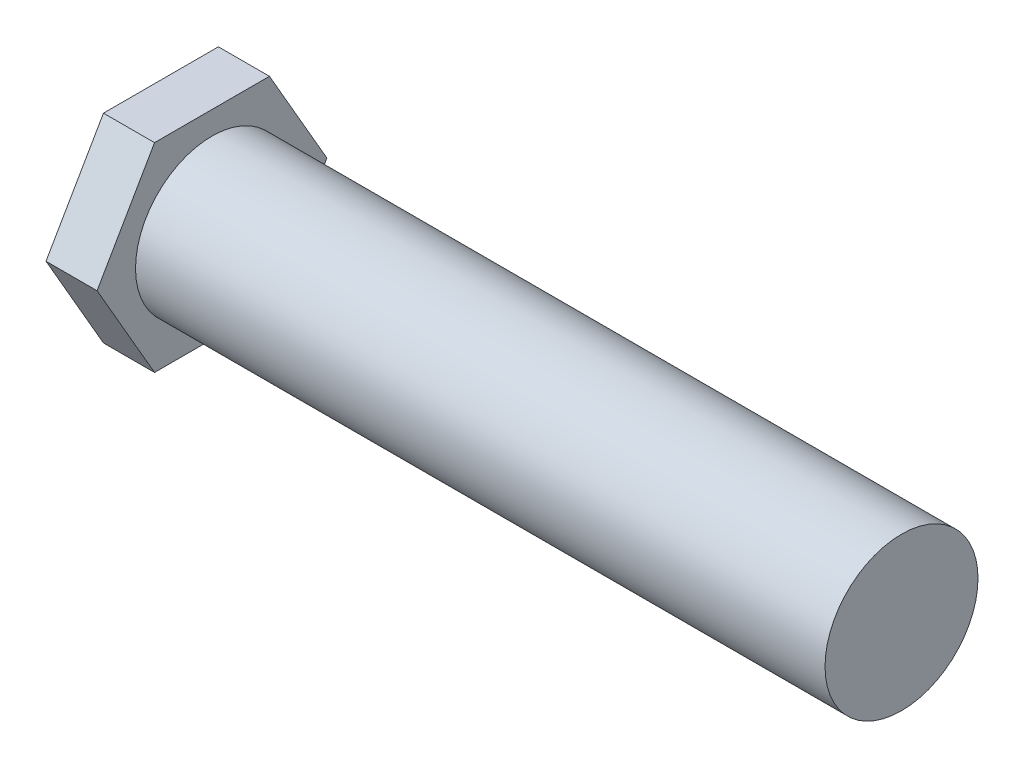
ISO-10303-21;
HEADER;
FILE_DESCRIPTION(('STEP AP214'),'2;1');
FILE_NAME('part.step','',(''),(''),'','','');
FILE_SCHEMA(('AUTOMOTIVE_DESIGN { 1 0 10303 214 1 1 1 1 }'));
ENDSEC;
DATA;
#1=APPLICATION_CONTEXT('core data for automotive mechanical design processes');
#2=APPLICATION_PROTOCOL_DEFINITION('international standard','automotive_design',2000,#1);
#3=PRODUCT_CONTEXT('',#1,'mechanical');
#4=PRODUCT('Part','Part','',(#3));
#5=PRODUCT_RELATED_PRODUCT_CATEGORY('part','',(#4));
#6=PRODUCT_DEFINITION_FORMATION('','',#4);
#7=PRODUCT_DEFINITION_CONTEXT('part definition',#1,'design');
#8=PRODUCT_DEFINITION('design','',#6,#7);
#9=PRODUCT_DEFINITION_SHAPE('','',#8);
#10=(LENGTH_UNIT() NAMED_UNIT(*) SI_UNIT(.MILLI.,.METRE.));
#11=(NAMED_UNIT(*) PLANE_ANGLE_UNIT() SI_UNIT($,.RADIAN.));
#12=(NAMED_UNIT(*) SI_UNIT($,.STERADIAN.) SOLID_ANGLE_UNIT());
#13=UNCERTAINTY_MEASURE_WITH_UNIT(LENGTH_MEASURE(1.E-05),#10,'distance_accuracy_value','');
#14=(GEOMETRIC_REPRESENTATION_CONTEXT(3) GLOBAL_UNCERTAINTY_ASSIGNED_CONTEXT((#13)) GLOBAL_UNIT_ASSIGNED_CONTEXT((#10,
#11,#12)) REPRESENTATION_CONTEXT('',''));
#15=CARTESIAN_POINT('',(0.,0.,0.));
#16=DIRECTION('',(0.,0.,1.));
#17=DIRECTION('',(1.,0.,0.));
#18=AXIS2_PLACEMENT_3D('',#15,#16,#17);
#19=CARTESIAN_POINT('',(270.,0.,0.));
#20=DIRECTION('',(-1.,0.,0.));
#21=DIRECTION('',(0.,0.,1.));
#22=AXIS2_PLACEMENT_3D('',#19,#20,#21);
#23=CYLINDRICAL_SURFACE('',#22,29.95);
#24=CARTESIAN_POINT('',(270.,0.,0.));
#25=DIRECTION('',(1.,0.,0.));
#26=DIRECTION('',(0.,0.,-1.));
#27=AXIS2_PLACEMENT_3D('',#24,#25,#26);
#28=CIRCLE('',#27,29.95);
#29=CARTESIAN_POINT('',(270.,0.,-29.95));
#30=VERTEX_POINT('',#29);
#31=EDGE_CURVE('E11',#30,#30,#28,.T.);
#32=ORIENTED_EDGE('',*,*,#31,.F.);
#33=EDGE_LOOP('',(#32));
#34=FACE_BOUND('',#33,.T.);
#35=CARTESIAN_POINT('',(0.,0.,0.));
#36=DIRECTION('',(-1.,0.,0.));
#37=DIRECTION('',(0.,0.,1.));
#38=AXIS2_PLACEMENT_3D('',#35,#36,#37);
#39=CIRCLE('',#38,29.95);
#40=CARTESIAN_POINT('',(0.,0.,29.95));
#41=VERTEX_POINT('',#40);
#42=EDGE_CURVE('E40',#41,#41,#39,.T.);
#43=ORIENTED_EDGE('',*,*,#42,.F.);
#44=EDGE_LOOP('',(#43));
#45=FACE_BOUND('',#44,.T.);
#46=ADVANCED_FACE('F32',(#34,#45),#23,.T.);
#47=CARTESIAN_POINT('',(270.,0.,0.));
#48=DIRECTION('',(1.,0.,0.));
#49=DIRECTION('',(0.,0.,-1.));
#50=AXIS2_PLACEMENT_3D('',#47,#48,#49);
#51=PLANE('',#50);
#52=ORIENTED_EDGE('',*,*,#31,.T.);
#53=EDGE_LOOP('',(#52));
#54=FACE_BOUND('',#53,.T.);
#55=ADVANCED_FACE('F141',(#54),#51,.T.);
#56=CARTESIAN_POINT('',(0.,0.,0.));
#57=DIRECTION('',(-1.,0.,0.));
#58=DIRECTION('',(0.,0.,1.));
#59=AXIS2_PLACEMENT_3D('',#56,#57,#58);
#60=PLANE('',#59);
#61=DIRECTION('',(0.,0.866025403784439,0.5));
#62=VECTOR('',#61,1.);
#63=CARTESIAN_POINT('',(0.,-38.9711431702998,22.5));
#64=LINE('',#63,#62);
#65=CARTESIAN_POINT('',(0.,-38.9711431702998,22.5));
#66=VERTEX_POINT('',#65);
#67=CARTESIAN_POINT('',(0.,0.,45.));
#68=VERTEX_POINT('',#67);
#69=EDGE_CURVE('E117',#66,#68,#64,.T.);
#70=ORIENTED_EDGE('',*,*,#69,.F.);
#71=DIRECTION('',(0.,0.,1.));
#72=VECTOR('',#71,1.);
#73=CARTESIAN_POINT('',(0.,-38.9711431702998,-22.5));
#74=LINE('',#73,#72);
#75=CARTESIAN_POINT('',(0.,-38.9711431702998,-22.5));
#76=VERTEX_POINT('',#75);
#77=EDGE_CURVE('E77',#76,#66,#74,.T.);
#78=ORIENTED_EDGE('',*,*,#77,.F.);
#79=DIRECTION('',(0.,-0.866025403784439,0.5));
#80=VECTOR('',#79,1.);
#81=CARTESIAN_POINT('',(0.,0.,-45.));
#82=LINE('',#81,#80);
#83=CARTESIAN_POINT('',(0.,0.,-45.));
#84=VERTEX_POINT('',#83);
#85=EDGE_CURVE('E71',#84,#76,#82,.T.);
#86=ORIENTED_EDGE('',*,*,#85,.F.);
#87=DIRECTION('',(0.,-0.866025403784439,-0.5));
#88=VECTOR('',#87,1.);
#89=CARTESIAN_POINT('',(0.,38.9711431702998,-22.5));
#90=LINE('',#89,#88);
#91=CARTESIAN_POINT('',(0.,38.9711431702998,-22.5));
#92=VERTEX_POINT('',#91);
#93=EDGE_CURVE('E107',#92,#84,#90,.T.);
#94=ORIENTED_EDGE('',*,*,#93,.F.);
#95=DIRECTION('',(0.,0.,-1.));
#96=VECTOR('',#95,1.);
#97=CARTESIAN_POINT('',(0.,38.9711431702998,22.5));
#98=LINE('',#97,#96);
#99=CARTESIAN_POINT('',(0.,38.9711431702998,22.5));
#100=VERTEX_POINT('',#99);
#101=EDGE_CURVE('E122',#100,#92,#98,.T.);
#102=ORIENTED_EDGE('',*,*,#101,.F.);
#103=DIRECTION('',(0.,0.866025403784439,-0.5));
#104=VECTOR('',#103,1.);
#105=CARTESIAN_POINT('',(0.,0.,45.));
#106=LINE('',#105,#104);
#107=EDGE_CURVE('E120',#68,#100,#106,.T.);
#108=ORIENTED_EDGE('',*,*,#107,.F.);
#109=EDGE_LOOP('',(#70,#78,#86,#94,#102,#108));
#110=FACE_BOUND('',#109,.T.);
#111=ORIENTED_EDGE('',*,*,#42,.T.);
#112=EDGE_LOOP('',(#111));
#113=FACE_BOUND('',#112,.T.);
#114=ADVANCED_FACE('F138',(#110,#113),#60,.F.);
#115=CARTESIAN_POINT('',(-20.,-38.9711431702998,22.5));
#116=DIRECTION('',(0.,0.5,-0.866025403784439));
#117=DIRECTION('',(0.,0.866025403784439,0.5));
#118=AXIS2_PLACEMENT_3D('',#115,#116,#117);
#119=PLANE('',#118);
#120=ORIENTED_EDGE('',*,*,#69,.T.);
#121=DIRECTION('',(1.,0.,0.));
#122=VECTOR('',#121,1.);
#123=CARTESIAN_POINT('',(-20.,0.,45.));
#124=LINE('',#123,#122);
#125=CARTESIAN_POINT('',(-20.,0.,45.));
#126=VERTEX_POINT('',#125);
#127=EDGE_CURVE('E134',#126,#68,#124,.T.);
#128=ORIENTED_EDGE('',*,*,#127,.F.);
#129=DIRECTION('',(0.,0.866025403784439,0.5));
#130=VECTOR('',#129,1.);
#131=CARTESIAN_POINT('',(-20.,-38.9711431702998,22.5));
#132=LINE('',#131,#130);
#133=CARTESIAN_POINT('',(-20.,-38.9711431702998,22.5));
#134=VERTEX_POINT('',#133);
#135=EDGE_CURVE('E127',#134,#126,#132,.T.);
#136=ORIENTED_EDGE('',*,*,#135,.F.);
#137=DIRECTION('',(1.,0.,0.));
#138=VECTOR('',#137,1.);
#139=CARTESIAN_POINT('',(-20.,-38.9711431702998,22.5));
#140=LINE('',#139,#138);
#141=EDGE_CURVE('E113',#134,#66,#140,.T.);
#142=ORIENTED_EDGE('',*,*,#141,.T.);
#143=EDGE_LOOP('',(#120,#128,#136,#142));
#144=FACE_BOUND('',#143,.T.);
#145=ADVANCED_FACE('F151',(#144),#119,.F.);
#146=CARTESIAN_POINT('',(-20.,0.,45.));
#147=DIRECTION('',(0.,-0.5,-0.866025403784438));
#148=DIRECTION('',(0.,0.866025403784439,-0.5));
#149=AXIS2_PLACEMENT_3D('',#146,#147,#148);
#150=PLANE('',#149);
#151=ORIENTED_EDGE('',*,*,#107,.T.);
#152=DIRECTION('',(1.,0.,0.));
#153=VECTOR('',#152,1.);
#154=CARTESIAN_POINT('',(-20.,38.9711431702998,22.5));
#155=LINE('',#154,#153);
#156=CARTESIAN_POINT('',(-20.,38.9711431702998,22.5));
#157=VERTEX_POINT('',#156);
#158=EDGE_CURVE('E131',#157,#100,#155,.T.);
#159=ORIENTED_EDGE('',*,*,#158,.F.);
#160=DIRECTION('',(0.,0.866025403784439,-0.5));
#161=VECTOR('',#160,1.);
#162=CARTESIAN_POINT('',(-20.,0.,45.));
#163=LINE('',#162,#161);
#164=EDGE_CURVE('E86',#126,#157,#163,.T.);
#165=ORIENTED_EDGE('',*,*,#164,.F.);
#166=ORIENTED_EDGE('',*,*,#127,.T.);
#167=EDGE_LOOP('',(#151,#159,#165,#166));
#168=FACE_BOUND('',#167,.T.);
#169=ADVANCED_FACE('F157',(#168),#150,.F.);
#170=CARTESIAN_POINT('',(-20.,38.9711431702998,22.5));
#171=DIRECTION('',(0.,-1.,0.));
#172=DIRECTION('',(0.,0.,-1.));
#173=AXIS2_PLACEMENT_3D('',#170,#171,#172);
#174=PLANE('',#173);
#175=ORIENTED_EDGE('',*,*,#101,.T.);
#176=DIRECTION('',(1.,0.,0.));
#177=VECTOR('',#176,1.);
#178=CARTESIAN_POINT('',(-20.,38.9711431702998,-22.5));
#179=LINE('',#178,#177);
#180=CARTESIAN_POINT('',(-20.,38.9711431702998,-22.5));
#181=VERTEX_POINT('',#180);
#182=EDGE_CURVE('E108',#181,#92,#179,.T.);
#183=ORIENTED_EDGE('',*,*,#182,.F.);
#184=DIRECTION('',(0.,0.,-1.));
#185=VECTOR('',#184,1.);
#186=CARTESIAN_POINT('',(-20.,38.9711431702998,22.5));
#187=LINE('',#186,#185);
#188=EDGE_CURVE('E99',#157,#181,#187,.T.);
#189=ORIENTED_EDGE('',*,*,#188,.F.);
#190=ORIENTED_EDGE('',*,*,#158,.T.);
#191=EDGE_LOOP('',(#175,#183,#189,#190));
#192=FACE_BOUND('',#191,.T.);
#193=ADVANCED_FACE('F161',(#192),#174,.F.);
#194=CARTESIAN_POINT('',(-20.,38.9711431702998,-22.5));
#195=DIRECTION('',(0.,-0.5,0.866025403784439));
#196=DIRECTION('',(0.,-0.866025403784439,-0.5));
#197=AXIS2_PLACEMENT_3D('',#194,#195,#196);
#198=PLANE('',#197);
#199=ORIENTED_EDGE('',*,*,#93,.T.);
#200=DIRECTION('',(1.,0.,0.));
#201=VECTOR('',#200,1.);
#202=CARTESIAN_POINT('',(-20.,0.,-45.));
#203=LINE('',#202,#201);
#204=CARTESIAN_POINT('',(-20.,0.,-45.));
#205=VERTEX_POINT('',#204);
#206=EDGE_CURVE('E104',#205,#84,#203,.T.);
#207=ORIENTED_EDGE('',*,*,#206,.F.);
#208=DIRECTION('',(0.,-0.866025403784439,-0.5));
#209=VECTOR('',#208,1.);
#210=CARTESIAN_POINT('',(-20.,38.9711431702998,-22.5));
#211=LINE('',#210,#209);
#212=EDGE_CURVE('E93',#181,#205,#211,.T.);
#213=ORIENTED_EDGE('',*,*,#212,.F.);
#214=ORIENTED_EDGE('',*,*,#182,.T.);
#215=EDGE_LOOP('',(#199,#207,#213,#214));
#216=FACE_BOUND('',#215,.T.);
#217=ADVANCED_FACE('F105',(#216),#198,.F.);
#218=CARTESIAN_POINT('',(-20.,0.,-45.));
#219=DIRECTION('',(0.,0.5,0.866025403784439));
#220=DIRECTION('',(0.,-0.866025403784439,0.5));
#221=AXIS2_PLACEMENT_3D('',#218,#219,#220);
#222=PLANE('',#221);
#223=ORIENTED_EDGE('',*,*,#85,.T.);
#224=DIRECTION('',(1.,0.,0.));
#225=VECTOR('',#224,1.);
#226=CARTESIAN_POINT('',(-20.,-38.9711431702998,-22.5));
#227=LINE('',#226,#225);
#228=CARTESIAN_POINT('',(-20.,-38.9711431702998,-22.5));
#229=VERTEX_POINT('',#228);
#230=EDGE_CURVE('E109',#229,#76,#227,.T.);
#231=ORIENTED_EDGE('',*,*,#230,.F.);
#232=DIRECTION('',(0.,-0.866025403784439,0.5));
#233=VECTOR('',#232,1.);
#234=CARTESIAN_POINT('',(-20.,0.,-45.));
#235=LINE('',#234,#233);
#236=EDGE_CURVE('E97',#205,#229,#235,.T.);
#237=ORIENTED_EDGE('',*,*,#236,.F.);
#238=ORIENTED_EDGE('',*,*,#206,.T.);
#239=EDGE_LOOP('',(#223,#231,#237,#238));
#240=FACE_BOUND('',#239,.T.);
#241=ADVANCED_FACE('F111',(#240),#222,.F.);
#242=CARTESIAN_POINT('',(-20.,-38.9711431702998,-22.5));
#243=DIRECTION('',(0.,1.,0.));
#244=DIRECTION('',(0.,0.,1.));
#245=AXIS2_PLACEMENT_3D('',#242,#243,#244);
#246=PLANE('',#245);
#247=ORIENTED_EDGE('',*,*,#77,.T.);
#248=ORIENTED_EDGE('',*,*,#141,.F.);
#249=DIRECTION('',(0.,0.,1.));
#250=VECTOR('',#249,1.);
#251=CARTESIAN_POINT('',(-20.,-38.9711431702998,-22.5));
#252=LINE('',#251,#250);
#253=EDGE_CURVE('E48',#229,#134,#252,.T.);
#254=ORIENTED_EDGE('',*,*,#253,.F.);
#255=ORIENTED_EDGE('',*,*,#230,.T.);
#256=EDGE_LOOP('',(#247,#248,#254,#255));
#257=FACE_BOUND('',#256,.T.);
#258=ADVANCED_FACE('F169',(#257),#246,.F.);
#259=CARTESIAN_POINT('',(-20.,0.,0.));
#260=DIRECTION('',(-1.,0.,0.));
#261=DIRECTION('',(0.,0.,1.));
#262=AXIS2_PLACEMENT_3D('',#259,#260,#261);
#263=PLANE('',#262);
#264=ORIENTED_EDGE('',*,*,#135,.T.);
#265=ORIENTED_EDGE('',*,*,#164,.T.);
#266=ORIENTED_EDGE('',*,*,#188,.T.);
#267=ORIENTED_EDGE('',*,*,#212,.T.);
#268=ORIENTED_EDGE('',*,*,#236,.T.);
#269=ORIENTED_EDGE('',*,*,#253,.T.);
#270=EDGE_LOOP('',(#264,#265,#266,#267,#268,#269));
#271=FACE_BOUND('',#270,.T.);
#272=ADVANCED_FACE('F95',(#271),#263,.T.);
#273=CLOSED_SHELL('',(#46,#55,#114,#145,#169,#193,#217,#241,#258,#272));
#274=MANIFOLD_SOLID_BREP('B2',#273);
#275=ADVANCED_BREP_SHAPE_REPRESENTATION('',(#18,#274),#14);
#276=SHAPE_DEFINITION_REPRESENTATION(#9,#275);
ENDSEC;
END-ISO-10303-21;
